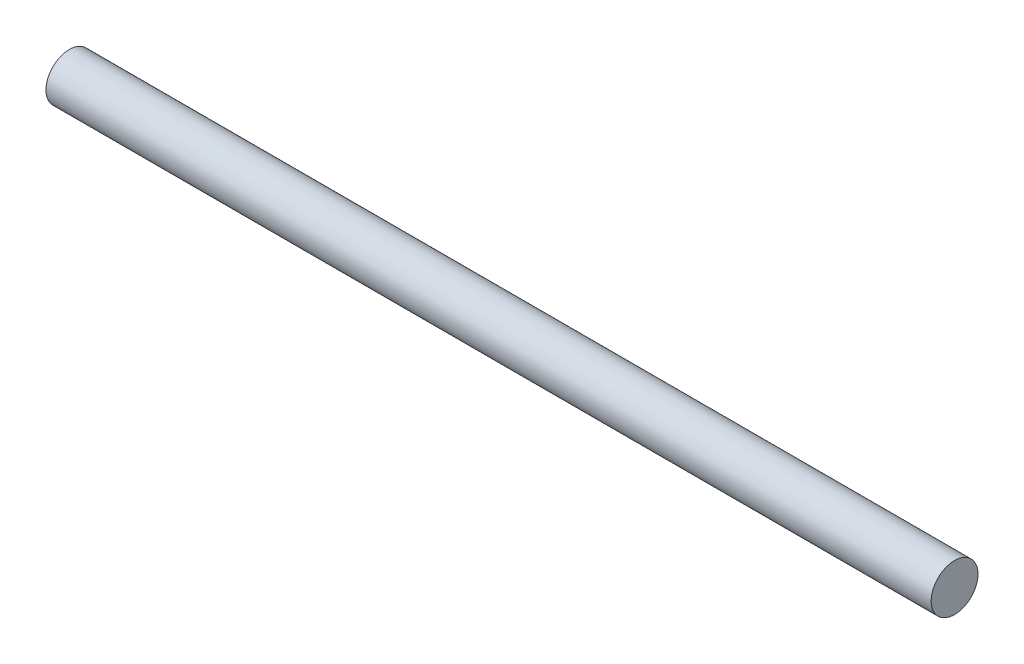
ISO-10303-21;
HEADER;
FILE_DESCRIPTION(('STEP AP214'),'2;1');
FILE_NAME('part.step','',(''),(''),'','','');
FILE_SCHEMA(('AUTOMOTIVE_DESIGN { 1 0 10303 214 1 1 1 1 }'));
ENDSEC;
DATA;
#1=APPLICATION_CONTEXT('core data for automotive mechanical design processes');
#2=APPLICATION_PROTOCOL_DEFINITION('international standard','automotive_design',2000,#1);
#3=PRODUCT_CONTEXT('',#1,'mechanical');
#4=PRODUCT('Part','Part','',(#3));
#5=PRODUCT_RELATED_PRODUCT_CATEGORY('part','',(#4));
#6=PRODUCT_DEFINITION_FORMATION('','',#4);
#7=PRODUCT_DEFINITION_CONTEXT('part definition',#1,'design');
#8=PRODUCT_DEFINITION('design','',#6,#7);
#9=PRODUCT_DEFINITION_SHAPE('','',#8);
#10=(LENGTH_UNIT() NAMED_UNIT(*) SI_UNIT(.MILLI.,.METRE.));
#11=(NAMED_UNIT(*) PLANE_ANGLE_UNIT() SI_UNIT($,.RADIAN.));
#12=(NAMED_UNIT(*) SI_UNIT($,.STERADIAN.) SOLID_ANGLE_UNIT());
#13=UNCERTAINTY_MEASURE_WITH_UNIT(LENGTH_MEASURE(1.E-05),#10,'distance_accuracy_value','');
#14=(GEOMETRIC_REPRESENTATION_CONTEXT(3) GLOBAL_UNCERTAINTY_ASSIGNED_CONTEXT((#13)) GLOBAL_UNIT_ASSIGNED_CONTEXT((#10,
#11,#12)) REPRESENTATION_CONTEXT('',''));
#15=CARTESIAN_POINT('',(0.,0.,0.));
#16=DIRECTION('',(0.,0.,1.));
#17=DIRECTION('',(1.,0.,0.));
#18=AXIS2_PLACEMENT_3D('',#15,#16,#17);
#19=CARTESIAN_POINT('',(150.,0.,0.));
#20=DIRECTION('',(-1.,0.,0.));
#21=DIRECTION('',(0.,0.,1.));
#22=AXIS2_PLACEMENT_3D('',#19,#20,#21);
#23=CYLINDRICAL_SURFACE('',#22,3.96875);
#24=CARTESIAN_POINT('',(150.,0.,0.));
#25=DIRECTION('',(1.,0.,0.));
#26=DIRECTION('',(0.,0.,-1.));
#27=AXIS2_PLACEMENT_3D('',#24,#25,#26);
#28=CIRCLE('',#27,3.96875);
#29=CARTESIAN_POINT('',(150.,0.,-3.96875));
#30=VERTEX_POINT('',#29);
#31=EDGE_CURVE('E10',#30,#30,#28,.T.);
#32=ORIENTED_EDGE('',*,*,#31,.F.);
#33=EDGE_LOOP('',(#32));
#34=FACE_BOUND('',#33,.T.);
#35=CARTESIAN_POINT('',(0.,0.,0.));
#36=DIRECTION('',(1.,0.,0.));
#37=DIRECTION('',(0.,0.,-1.));
#38=AXIS2_PLACEMENT_3D('',#35,#36,#37);
#39=CIRCLE('',#38,3.96875);
#40=CARTESIAN_POINT('',(0.,0.,-3.96875));
#41=VERTEX_POINT('',#40);
#42=EDGE_CURVE('E34',#41,#41,#39,.T.);
#43=ORIENTED_EDGE('',*,*,#42,.T.);
#44=EDGE_LOOP('',(#43));
#45=FACE_BOUND('',#44,.T.);
#46=ADVANCED_FACE('F31',(#34,#45),#23,.T.);
#47=CARTESIAN_POINT('',(150.,0.,0.));
#48=DIRECTION('',(1.,0.,0.));
#49=DIRECTION('',(0.,0.,-1.));
#50=AXIS2_PLACEMENT_3D('',#47,#48,#49);
#51=PLANE('',#50);
#52=ORIENTED_EDGE('',*,*,#31,.T.);
#53=EDGE_LOOP('',(#52));
#54=FACE_BOUND('',#53,.T.);
#55=ADVANCED_FACE('F46',(#54),#51,.T.);
#56=CARTESIAN_POINT('',(0.,0.,0.));
#57=DIRECTION('',(1.,0.,0.));
#58=DIRECTION('',(0.,0.,-1.));
#59=AXIS2_PLACEMENT_3D('',#56,#57,#58);
#60=PLANE('',#59);
#61=ORIENTED_EDGE('',*,*,#42,.F.);
#62=EDGE_LOOP('',(#61));
#63=FACE_BOUND('',#62,.T.);
#64=ADVANCED_FACE('F44',(#63),#60,.F.);
#65=CLOSED_SHELL('',(#46,#55,#64));
#66=MANIFOLD_SOLID_BREP('B2',#65);
#67=ADVANCED_BREP_SHAPE_REPRESENTATION('',(#18,#66),#14);
#68=SHAPE_DEFINITION_REPRESENTATION(#9,#67);
ENDSEC;
END-ISO-10303-21;
